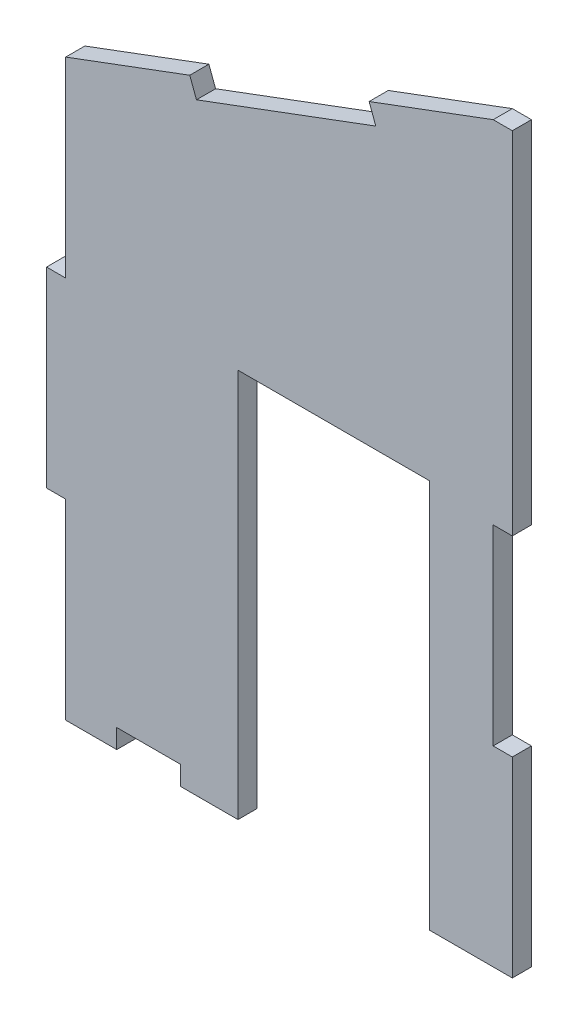
ISO-10303-21;
HEADER;
FILE_DESCRIPTION(('STEP AP214'),'2;1');
FILE_NAME('part.step','',(''),(''),'','','');
FILE_SCHEMA(('AUTOMOTIVE_DESIGN { 1 0 10303 214 1 1 1 1 }'));
ENDSEC;
DATA;
#1=APPLICATION_CONTEXT('core data for automotive mechanical design processes');
#2=APPLICATION_PROTOCOL_DEFINITION('international standard','automotive_design',2000,#1);
#3=PRODUCT_CONTEXT('',#1,'mechanical');
#4=PRODUCT('Part','Part','',(#3));
#5=PRODUCT_RELATED_PRODUCT_CATEGORY('part','',(#4));
#6=PRODUCT_DEFINITION_FORMATION('','',#4);
#7=PRODUCT_DEFINITION_CONTEXT('part definition',#1,'design');
#8=PRODUCT_DEFINITION('design','',#6,#7);
#9=PRODUCT_DEFINITION_SHAPE('','',#8);
#10=(LENGTH_UNIT() NAMED_UNIT(*) SI_UNIT(.MILLI.,.METRE.));
#11=(NAMED_UNIT(*) PLANE_ANGLE_UNIT() SI_UNIT($,.RADIAN.));
#12=(NAMED_UNIT(*) SI_UNIT($,.STERADIAN.) SOLID_ANGLE_UNIT());
#13=UNCERTAINTY_MEASURE_WITH_UNIT(LENGTH_MEASURE(1.E-05),#10,'distance_accuracy_value','');
#14=(GEOMETRIC_REPRESENTATION_CONTEXT(3) GLOBAL_UNCERTAINTY_ASSIGNED_CONTEXT((#13)) GLOBAL_UNIT_ASSIGNED_CONTEXT((#10,
#11,#12)) REPRESENTATION_CONTEXT('',''));
#15=CARTESIAN_POINT('',(0.,0.,0.));
#16=DIRECTION('',(0.,0.,1.));
#17=DIRECTION('',(1.,0.,0.));
#18=AXIS2_PLACEMENT_3D('',#15,#16,#17);
#19=CARTESIAN_POINT('',(251.627918025392,254.123752973224,3.));
#20=DIRECTION('',(-1.,0.,0.));
#21=DIRECTION('',(0.,-1.,0.));
#22=AXIS2_PLACEMENT_3D('',#19,#20,#21);
#23=PLANE('',#22);
#24=DIRECTION('',(0.,1.,0.));
#25=VECTOR('',#24,1.);
#26=CARTESIAN_POINT('',(251.627918025392,254.123752973224,0.));
#27=LINE('',#26,#25);
#28=CARTESIAN_POINT('',(251.627918025392,199.123752973223,0.));
#29=VERTEX_POINT('',#28);
#30=CARTESIAN_POINT('',(251.627918025392,254.123752973224,0.));
#31=VERTEX_POINT('',#30);
#32=EDGE_CURVE('E231',#29,#31,#27,.T.);
#33=ORIENTED_EDGE('',*,*,#32,.T.);
#34=DIRECTION('',(0.,0.,-1.));
#35=VECTOR('',#34,1.);
#36=CARTESIAN_POINT('',(251.627918025392,254.123752973224,3.));
#37=LINE('',#36,#35);
#38=CARTESIAN_POINT('',(251.627918025392,254.123752973224,3.));
#39=VERTEX_POINT('',#38);
#40=EDGE_CURVE('E11',#39,#31,#37,.T.);
#41=ORIENTED_EDGE('',*,*,#40,.F.);
#42=DIRECTION('',(0.,1.,0.));
#43=VECTOR('',#42,1.);
#44=CARTESIAN_POINT('',(251.627918025392,254.123752973224,3.));
#45=LINE('',#44,#43);
#46=CARTESIAN_POINT('',(251.627918025392,199.123752973223,3.));
#47=VERTEX_POINT('',#46);
#48=EDGE_CURVE('E279',#47,#39,#45,.T.);
#49=ORIENTED_EDGE('',*,*,#48,.F.);
#50=DIRECTION('',(0.,0.,-1.));
#51=VECTOR('',#50,1.);
#52=CARTESIAN_POINT('',(251.627918025392,199.123752973223,3.));
#53=LINE('',#52,#51);
#54=EDGE_CURVE('E227',#47,#29,#53,.T.);
#55=ORIENTED_EDGE('',*,*,#54,.T.);
#56=EDGE_LOOP('',(#33,#41,#49,#55));
#57=FACE_BOUND('',#56,.T.);
#58=ADVANCED_FACE('F33',(#57),#23,.F.);
#59=CARTESIAN_POINT('',(248.627918025392,254.123752973223,3.));
#60=DIRECTION('',(0.,-1.,0.));
#61=DIRECTION('',(1.,0.,0.));
#62=AXIS2_PLACEMENT_3D('',#59,#60,#61);
#63=PLANE('',#62);
#64=DIRECTION('',(-1.,0.,0.));
#65=VECTOR('',#64,1.);
#66=CARTESIAN_POINT('',(248.627918025392,254.123752973223,0.));
#67=LINE('',#66,#65);
#68=CARTESIAN_POINT('',(248.627918025392,254.123752973223,0.));
#69=VERTEX_POINT('',#68);
#70=EDGE_CURVE('E234',#31,#69,#67,.T.);
#71=ORIENTED_EDGE('',*,*,#70,.T.);
#72=DIRECTION('',(0.,0.,-1.));
#73=VECTOR('',#72,1.);
#74=CARTESIAN_POINT('',(248.627918025392,254.123752973223,3.));
#75=LINE('',#74,#73);
#76=CARTESIAN_POINT('',(248.627918025392,254.123752973223,3.));
#77=VERTEX_POINT('',#76);
#78=EDGE_CURVE('E41',#77,#69,#75,.T.);
#79=ORIENTED_EDGE('',*,*,#78,.F.);
#80=DIRECTION('',(-1.,0.,0.));
#81=VECTOR('',#80,1.);
#82=CARTESIAN_POINT('',(248.627918025392,254.123752973223,3.));
#83=LINE('',#82,#81);
#84=EDGE_CURVE('E143',#39,#77,#83,.T.);
#85=ORIENTED_EDGE('',*,*,#84,.F.);
#86=ORIENTED_EDGE('',*,*,#40,.T.);
#87=EDGE_LOOP('',(#71,#79,#85,#86));
#88=FACE_BOUND('',#87,.T.);
#89=ADVANCED_FACE('F422',(#88),#63,.F.);
#90=CARTESIAN_POINT('',(248.627918025392,254.123752973223,3.));
#91=DIRECTION('',(0.349590519725871,-0.936902592865339,0.));
#92=DIRECTION('',(0.936902592865339,0.349590519725871,0.));
#93=AXIS2_PLACEMENT_3D('',#90,#91,#92);
#94=PLANE('',#93);
#95=DIRECTION('',(-0.936902592865339,-0.349590519725871,0.));
#96=VECTOR('',#95,1.);
#97=CARTESIAN_POINT('',(248.627918025392,254.123752973223,0.));
#98=LINE('',#97,#96);
#99=CARTESIAN_POINT('',(229.181456918372,246.867610769112,0.));
#100=VERTEX_POINT('',#99);
#101=EDGE_CURVE('E236',#69,#100,#98,.T.);
#102=ORIENTED_EDGE('',*,*,#101,.T.);
#103=DIRECTION('',(0.,0.,-1.));
#104=VECTOR('',#103,1.);
#105=CARTESIAN_POINT('',(229.181456918372,246.867610769112,3.));
#106=LINE('',#105,#104);
#107=CARTESIAN_POINT('',(229.181456918372,246.867610769112,3.));
#108=VERTEX_POINT('',#107);
#109=EDGE_CURVE('E337',#108,#100,#106,.T.);
#110=ORIENTED_EDGE('',*,*,#109,.F.);
#111=DIRECTION('',(-0.936902592865339,-0.349590519725871,0.));
#112=VECTOR('',#111,1.);
#113=CARTESIAN_POINT('',(248.627918025392,254.123752973223,3.));
#114=LINE('',#113,#112);
#115=EDGE_CURVE('E345',#77,#108,#114,.T.);
#116=ORIENTED_EDGE('',*,*,#115,.F.);
#117=ORIENTED_EDGE('',*,*,#78,.T.);
#118=EDGE_LOOP('',(#102,#110,#116,#117));
#119=FACE_BOUND('',#118,.T.);
#120=ADVANCED_FACE('F343',(#119),#94,.F.);
#121=CARTESIAN_POINT('',(229.181456918372,246.867610769112,3.));
#122=DIRECTION('',(0.936902592865339,0.349590519725872,0.));
#123=DIRECTION('',(-0.349590519725873,0.936902592865339,0.));
#124=AXIS2_PLACEMENT_3D('',#121,#122,#123);
#125=PLANE('',#124);
#126=DIRECTION('',(0.349590519725873,-0.936902592865339,0.));
#127=VECTOR('',#126,1.);
#128=CARTESIAN_POINT('',(229.181456918372,246.867610769112,0.));
#129=LINE('',#128,#127);
#130=CARTESIAN_POINT('',(230.230228477549,244.056902990516,0.));
#131=VERTEX_POINT('',#130);
#132=EDGE_CURVE('E238',#100,#131,#129,.T.);
#133=ORIENTED_EDGE('',*,*,#132,.T.);
#134=DIRECTION('',(0.,0.,-1.));
#135=VECTOR('',#134,1.);
#136=CARTESIAN_POINT('',(230.230228477549,244.056902990516,3.));
#137=LINE('',#136,#135);
#138=CARTESIAN_POINT('',(230.230228477549,244.056902990516,3.));
#139=VERTEX_POINT('',#138);
#140=EDGE_CURVE('E334',#139,#131,#137,.T.);
#141=ORIENTED_EDGE('',*,*,#140,.F.);
#142=DIRECTION('',(0.349590519725873,-0.936902592865339,0.));
#143=VECTOR('',#142,1.);
#144=CARTESIAN_POINT('',(229.181456918372,246.867610769112,3.));
#145=LINE('',#144,#143);
#146=EDGE_CURVE('E363',#108,#139,#145,.T.);
#147=ORIENTED_EDGE('',*,*,#146,.F.);
#148=ORIENTED_EDGE('',*,*,#109,.T.);
#149=EDGE_LOOP('',(#133,#141,#147,#148));
#150=FACE_BOUND('',#149,.T.);
#151=ADVANCED_FACE('F354',(#150),#125,.F.);
#152=CARTESIAN_POINT('',(230.230228477549,244.056902990516,3.));
#153=DIRECTION('',(0.349590519725873,-0.936902592865338,0.));
#154=DIRECTION('',(0.936902592865338,0.349590519725873,0.));
#155=AXIS2_PLACEMENT_3D('',#152,#153,#154);
#156=PLANE('',#155);
#157=DIRECTION('',(-0.936902592865339,-0.349590519725873,0.));
#158=VECTOR('',#157,1.);
#159=CARTESIAN_POINT('',(230.230228477549,244.056902990516,0.));
#160=LINE('',#159,#158);
#161=CARTESIAN_POINT('',(202.123150691589,233.569187398739,0.));
#162=VERTEX_POINT('',#161);
#163=EDGE_CURVE('E240',#131,#162,#160,.T.);
#164=ORIENTED_EDGE('',*,*,#163,.T.);
#165=DIRECTION('',(0.,0.,-1.));
#166=VECTOR('',#165,1.);
#167=CARTESIAN_POINT('',(202.123150691589,233.569187398739,3.));
#168=LINE('',#167,#166);
#169=CARTESIAN_POINT('',(202.123150691589,233.569187398739,3.));
#170=VERTEX_POINT('',#169);
#171=EDGE_CURVE('E331',#170,#162,#168,.T.);
#172=ORIENTED_EDGE('',*,*,#171,.F.);
#173=DIRECTION('',(-0.936902592865339,-0.349590519725873,0.));
#174=VECTOR('',#173,1.);
#175=CARTESIAN_POINT('',(230.230228477549,244.056902990516,3.));
#176=LINE('',#175,#174);
#177=EDGE_CURVE('E360',#139,#170,#176,.T.);
#178=ORIENTED_EDGE('',*,*,#177,.F.);
#179=ORIENTED_EDGE('',*,*,#140,.T.);
#180=EDGE_LOOP('',(#164,#172,#178,#179));
#181=FACE_BOUND('',#180,.T.);
#182=ADVANCED_FACE('F358',(#181),#156,.F.);
#183=CARTESIAN_POINT('',(201.074379132412,236.379895177335,3.));
#184=DIRECTION('',(-0.936902592865339,-0.349590519725872,0.));
#185=DIRECTION('',(0.349590519725873,-0.936902592865339,0.));
#186=AXIS2_PLACEMENT_3D('',#183,#184,#185);
#187=PLANE('',#186);
#188=DIRECTION('',(-0.349590519725873,0.936902592865339,0.));
#189=VECTOR('',#188,1.);
#190=CARTESIAN_POINT('',(201.074379132412,236.379895177335,0.));
#191=LINE('',#190,#189);
#192=CARTESIAN_POINT('',(201.074379132412,236.379895177335,0.));
#193=VERTEX_POINT('',#192);
#194=EDGE_CURVE('E242',#162,#193,#191,.T.);
#195=ORIENTED_EDGE('',*,*,#194,.T.);
#196=DIRECTION('',(0.,0.,-1.));
#197=VECTOR('',#196,1.);
#198=CARTESIAN_POINT('',(201.074379132412,236.379895177335,3.));
#199=LINE('',#198,#197);
#200=CARTESIAN_POINT('',(201.074379132412,236.379895177335,3.));
#201=VERTEX_POINT('',#200);
#202=EDGE_CURVE('E328',#201,#193,#199,.T.);
#203=ORIENTED_EDGE('',*,*,#202,.F.);
#204=DIRECTION('',(-0.349590519725873,0.936902592865339,0.));
#205=VECTOR('',#204,1.);
#206=CARTESIAN_POINT('',(201.074379132412,236.379895177335,3.));
#207=LINE('',#206,#205);
#208=EDGE_CURVE('E362',#170,#201,#207,.T.);
#209=ORIENTED_EDGE('',*,*,#208,.F.);
#210=ORIENTED_EDGE('',*,*,#171,.T.);
#211=EDGE_LOOP('',(#195,#203,#209,#210));
#212=FACE_BOUND('',#211,.T.);
#213=ADVANCED_FACE('F435',(#212),#187,.F.);
#214=CARTESIAN_POINT('',(201.074379132412,236.379895177335,3.));
#215=DIRECTION('',(0.349590519725873,-0.936902592865338,0.));
#216=DIRECTION('',(0.936902592865338,0.349590519725873,0.));
#217=AXIS2_PLACEMENT_3D('',#214,#215,#216);
#218=PLANE('',#217);
#219=DIRECTION('',(-0.936902592865338,-0.349590519725873,0.));
#220=VECTOR('',#219,1.);
#221=CARTESIAN_POINT('',(201.074379132412,236.379895177335,0.));
#222=LINE('',#221,#220);
#223=CARTESIAN_POINT('',(181.627918025392,229.123752973223,0.));
#224=VERTEX_POINT('',#223);
#225=EDGE_CURVE('E244',#193,#224,#222,.T.);
#226=ORIENTED_EDGE('',*,*,#225,.T.);
#227=DIRECTION('',(0.,0.,-1.));
#228=VECTOR('',#227,1.);
#229=CARTESIAN_POINT('',(181.627918025392,229.123752973223,3.));
#230=LINE('',#229,#228);
#231=CARTESIAN_POINT('',(181.627918025392,229.123752973223,3.));
#232=VERTEX_POINT('',#231);
#233=EDGE_CURVE('E325',#232,#224,#230,.T.);
#234=ORIENTED_EDGE('',*,*,#233,.F.);
#235=DIRECTION('',(-0.936902592865338,-0.349590519725873,0.));
#236=VECTOR('',#235,1.);
#237=CARTESIAN_POINT('',(201.074379132412,236.379895177335,3.));
#238=LINE('',#237,#236);
#239=EDGE_CURVE('E365',#201,#232,#238,.T.);
#240=ORIENTED_EDGE('',*,*,#239,.F.);
#241=ORIENTED_EDGE('',*,*,#202,.T.);
#242=EDGE_LOOP('',(#226,#234,#240,#241));
#243=FACE_BOUND('',#242,.T.);
#244=ADVANCED_FACE('F438',(#243),#218,.F.);
#245=CARTESIAN_POINT('',(181.627918025392,199.123752973223,3.));
#246=DIRECTION('',(1.,0.,0.));
#247=DIRECTION('',(0.,0.,-1.));
#248=AXIS2_PLACEMENT_3D('',#245,#246,#247);
#249=PLANE('',#248);
#250=DIRECTION('',(0.,-1.,0.));
#251=VECTOR('',#250,1.);
#252=CARTESIAN_POINT('',(181.627918025392,199.123752973223,0.));
#253=LINE('',#252,#251);
#254=CARTESIAN_POINT('',(181.627918025392,199.123752973223,0.));
#255=VERTEX_POINT('',#254);
#256=EDGE_CURVE('E246',#224,#255,#253,.T.);
#257=ORIENTED_EDGE('',*,*,#256,.T.);
#258=DIRECTION('',(0.,0.,-1.));
#259=VECTOR('',#258,1.);
#260=CARTESIAN_POINT('',(181.627918025392,199.123752973223,3.));
#261=LINE('',#260,#259);
#262=CARTESIAN_POINT('',(181.627918025392,199.123752973223,3.));
#263=VERTEX_POINT('',#262);
#264=EDGE_CURVE('E322',#263,#255,#261,.T.);
#265=ORIENTED_EDGE('',*,*,#264,.F.);
#266=DIRECTION('',(0.,-1.,0.));
#267=VECTOR('',#266,1.);
#268=CARTESIAN_POINT('',(181.627918025392,199.123752973223,3.));
#269=LINE('',#268,#267);
#270=EDGE_CURVE('E371',#232,#263,#269,.T.);
#271=ORIENTED_EDGE('',*,*,#270,.F.);
#272=ORIENTED_EDGE('',*,*,#233,.T.);
#273=EDGE_LOOP('',(#257,#265,#271,#272));
#274=FACE_BOUND('',#273,.T.);
#275=ADVANCED_FACE('F442',(#274),#249,.F.);
#276=CARTESIAN_POINT('',(178.627918025392,199.123752973223,3.));
#277=DIRECTION('',(0.,-1.,0.));
#278=DIRECTION('',(1.,0.,0.));
#279=AXIS2_PLACEMENT_3D('',#276,#277,#278);
#280=PLANE('',#279);
#281=DIRECTION('',(-1.,0.,0.));
#282=VECTOR('',#281,1.);
#283=CARTESIAN_POINT('',(178.627918025392,199.123752973223,0.));
#284=LINE('',#283,#282);
#285=CARTESIAN_POINT('',(178.627918025392,199.123752973223,0.));
#286=VERTEX_POINT('',#285);
#287=EDGE_CURVE('E248',#255,#286,#284,.T.);
#288=ORIENTED_EDGE('',*,*,#287,.T.);
#289=DIRECTION('',(0.,0.,-1.));
#290=VECTOR('',#289,1.);
#291=CARTESIAN_POINT('',(178.627918025392,199.123752973223,3.));
#292=LINE('',#291,#290);
#293=CARTESIAN_POINT('',(178.627918025392,199.123752973223,3.));
#294=VERTEX_POINT('',#293);
#295=EDGE_CURVE('E319',#294,#286,#292,.T.);
#296=ORIENTED_EDGE('',*,*,#295,.F.);
#297=DIRECTION('',(-1.,0.,0.));
#298=VECTOR('',#297,1.);
#299=CARTESIAN_POINT('',(178.627918025392,199.123752973223,3.));
#300=LINE('',#299,#298);
#301=EDGE_CURVE('E373',#263,#294,#300,.T.);
#302=ORIENTED_EDGE('',*,*,#301,.F.);
#303=ORIENTED_EDGE('',*,*,#264,.T.);
#304=EDGE_LOOP('',(#288,#296,#302,#303));
#305=FACE_BOUND('',#304,.T.);
#306=ADVANCED_FACE('F446',(#305),#280,.F.);
#307=CARTESIAN_POINT('',(178.627918025392,199.123752973223,3.));
#308=DIRECTION('',(1.,0.,0.));
#309=DIRECTION('',(0.,0.,-1.));
#310=AXIS2_PLACEMENT_3D('',#307,#308,#309);
#311=PLANE('',#310);
#312=DIRECTION('',(0.,-1.,0.));
#313=VECTOR('',#312,1.);
#314=CARTESIAN_POINT('',(178.627918025392,199.123752973223,0.));
#315=LINE('',#314,#313);
#316=CARTESIAN_POINT('',(178.627918025392,169.123752973223,0.));
#317=VERTEX_POINT('',#316);
#318=EDGE_CURVE('E250',#286,#317,#315,.T.);
#319=ORIENTED_EDGE('',*,*,#318,.T.);
#320=DIRECTION('',(0.,0.,-1.));
#321=VECTOR('',#320,1.);
#322=CARTESIAN_POINT('',(178.627918025392,169.123752973223,3.));
#323=LINE('',#322,#321);
#324=CARTESIAN_POINT('',(178.627918025392,169.123752973223,3.));
#325=VERTEX_POINT('',#324);
#326=EDGE_CURVE('E316',#325,#317,#323,.T.);
#327=ORIENTED_EDGE('',*,*,#326,.F.);
#328=DIRECTION('',(0.,-1.,0.));
#329=VECTOR('',#328,1.);
#330=CARTESIAN_POINT('',(178.627918025392,199.123752973223,3.));
#331=LINE('',#330,#329);
#332=EDGE_CURVE('E375',#294,#325,#331,.T.);
#333=ORIENTED_EDGE('',*,*,#332,.F.);
#334=ORIENTED_EDGE('',*,*,#295,.T.);
#335=EDGE_LOOP('',(#319,#327,#333,#334));
#336=FACE_BOUND('',#335,.T.);
#337=ADVANCED_FACE('F450',(#336),#311,.F.);
#338=CARTESIAN_POINT('',(181.627918025392,169.123752973223,3.));
#339=DIRECTION('',(0.,1.,0.));
#340=DIRECTION('',(-1.,0.,0.));
#341=AXIS2_PLACEMENT_3D('',#338,#339,#340);
#342=PLANE('',#341);
#343=DIRECTION('',(1.,0.,0.));
#344=VECTOR('',#343,1.);
#345=CARTESIAN_POINT('',(181.627918025392,169.123752973223,0.));
#346=LINE('',#345,#344);
#347=CARTESIAN_POINT('',(181.627918025392,169.123752973223,0.));
#348=VERTEX_POINT('',#347);
#349=EDGE_CURVE('E252',#317,#348,#346,.T.);
#350=ORIENTED_EDGE('',*,*,#349,.T.);
#351=DIRECTION('',(0.,0.,-1.));
#352=VECTOR('',#351,1.);
#353=CARTESIAN_POINT('',(181.627918025392,169.123752973223,3.));
#354=LINE('',#353,#352);
#355=CARTESIAN_POINT('',(181.627918025392,169.123752973223,3.));
#356=VERTEX_POINT('',#355);
#357=EDGE_CURVE('E313',#356,#348,#354,.T.);
#358=ORIENTED_EDGE('',*,*,#357,.F.);
#359=DIRECTION('',(1.,0.,0.));
#360=VECTOR('',#359,1.);
#361=CARTESIAN_POINT('',(181.627918025392,169.123752973223,3.));
#362=LINE('',#361,#360);
#363=EDGE_CURVE('E377',#325,#356,#362,.T.);
#364=ORIENTED_EDGE('',*,*,#363,.F.);
#365=ORIENTED_EDGE('',*,*,#326,.T.);
#366=EDGE_LOOP('',(#350,#358,#364,#365));
#367=FACE_BOUND('',#366,.T.);
#368=ADVANCED_FACE('F454',(#367),#342,.F.);
#369=CARTESIAN_POINT('',(181.627918025392,139.123752973223,3.));
#370=DIRECTION('',(1.,0.,0.));
#371=DIRECTION('',(0.,0.,-1.));
#372=AXIS2_PLACEMENT_3D('',#369,#370,#371);
#373=PLANE('',#372);
#374=DIRECTION('',(0.,-1.,0.));
#375=VECTOR('',#374,1.);
#376=CARTESIAN_POINT('',(181.627918025392,139.123752973223,0.));
#377=LINE('',#376,#375);
#378=CARTESIAN_POINT('',(181.627918025392,139.123752973223,0.));
#379=VERTEX_POINT('',#378);
#380=EDGE_CURVE('E254',#348,#379,#377,.T.);
#381=ORIENTED_EDGE('',*,*,#380,.T.);
#382=DIRECTION('',(0.,0.,-1.));
#383=VECTOR('',#382,1.);
#384=CARTESIAN_POINT('',(181.627918025392,139.123752973223,3.));
#385=LINE('',#384,#383);
#386=CARTESIAN_POINT('',(181.627918025392,139.123752973223,3.));
#387=VERTEX_POINT('',#386);
#388=EDGE_CURVE('E310',#387,#379,#385,.T.);
#389=ORIENTED_EDGE('',*,*,#388,.F.);
#390=DIRECTION('',(0.,-1.,0.));
#391=VECTOR('',#390,1.);
#392=CARTESIAN_POINT('',(181.627918025392,139.123752973223,3.));
#393=LINE('',#392,#391);
#394=EDGE_CURVE('E379',#356,#387,#393,.T.);
#395=ORIENTED_EDGE('',*,*,#394,.F.);
#396=ORIENTED_EDGE('',*,*,#357,.T.);
#397=EDGE_LOOP('',(#381,#389,#395,#396));
#398=FACE_BOUND('',#397,.T.);
#399=ADVANCED_FACE('F458',(#398),#373,.F.);
#400=CARTESIAN_POINT('',(181.627918025392,139.123752973223,3.));
#401=DIRECTION('',(0.,1.,0.));
#402=DIRECTION('',(-1.,0.,0.));
#403=AXIS2_PLACEMENT_3D('',#400,#401,#402);
#404=PLANE('',#403);
#405=DIRECTION('',(1.,0.,0.));
#406=VECTOR('',#405,1.);
#407=CARTESIAN_POINT('',(181.627918025392,139.123752973223,0.));
#408=LINE('',#407,#406);
#409=CARTESIAN_POINT('',(189.627918025392,139.123752973223,0.));
#410=VERTEX_POINT('',#409);
#411=EDGE_CURVE('E256',#379,#410,#408,.T.);
#412=ORIENTED_EDGE('',*,*,#411,.T.);
#413=DIRECTION('',(0.,0.,-1.));
#414=VECTOR('',#413,1.);
#415=CARTESIAN_POINT('',(189.627918025392,139.123752973223,3.));
#416=LINE('',#415,#414);
#417=CARTESIAN_POINT('',(189.627918025392,139.123752973223,3.));
#418=VERTEX_POINT('',#417);
#419=EDGE_CURVE('E307',#418,#410,#416,.T.);
#420=ORIENTED_EDGE('',*,*,#419,.F.);
#421=DIRECTION('',(1.,0.,0.));
#422=VECTOR('',#421,1.);
#423=CARTESIAN_POINT('',(181.627918025392,139.123752973223,3.));
#424=LINE('',#423,#422);
#425=EDGE_CURVE('E381',#387,#418,#424,.T.);
#426=ORIENTED_EDGE('',*,*,#425,.F.);
#427=ORIENTED_EDGE('',*,*,#388,.T.);
#428=EDGE_LOOP('',(#412,#420,#426,#427));
#429=FACE_BOUND('',#428,.T.);
#430=ADVANCED_FACE('F462',(#429),#404,.F.);
#431=CARTESIAN_POINT('',(189.627918025392,139.123752973223,3.));
#432=DIRECTION('',(-1.,0.,0.));
#433=DIRECTION('',(0.,0.,1.));
#434=AXIS2_PLACEMENT_3D('',#431,#432,#433);
#435=PLANE('',#434);
#436=DIRECTION('',(0.,1.,0.));
#437=VECTOR('',#436,1.);
#438=CARTESIAN_POINT('',(189.627918025392,139.123752973223,0.));
#439=LINE('',#438,#437);
#440=CARTESIAN_POINT('',(189.627918025392,142.123752973223,0.));
#441=VERTEX_POINT('',#440);
#442=EDGE_CURVE('E258',#410,#441,#439,.T.);
#443=ORIENTED_EDGE('',*,*,#442,.T.);
#444=DIRECTION('',(0.,0.,-1.));
#445=VECTOR('',#444,1.);
#446=CARTESIAN_POINT('',(189.627918025392,142.123752973223,3.));
#447=LINE('',#446,#445);
#448=CARTESIAN_POINT('',(189.627918025392,142.123752973223,3.));
#449=VERTEX_POINT('',#448);
#450=EDGE_CURVE('E304',#449,#441,#447,.T.);
#451=ORIENTED_EDGE('',*,*,#450,.F.);
#452=DIRECTION('',(0.,1.,0.));
#453=VECTOR('',#452,1.);
#454=CARTESIAN_POINT('',(189.627918025392,139.123752973223,3.));
#455=LINE('',#454,#453);
#456=EDGE_CURVE('E383',#418,#449,#455,.T.);
#457=ORIENTED_EDGE('',*,*,#456,.F.);
#458=ORIENTED_EDGE('',*,*,#419,.T.);
#459=EDGE_LOOP('',(#443,#451,#457,#458));
#460=FACE_BOUND('',#459,.T.);
#461=ADVANCED_FACE('F466',(#460),#435,.F.);
#462=CARTESIAN_POINT('',(189.627918025392,142.123752973223,3.));
#463=DIRECTION('',(0.,1.,0.));
#464=DIRECTION('',(0.,0.,1.));
#465=AXIS2_PLACEMENT_3D('',#462,#463,#464);
#466=PLANE('',#465);
#467=DIRECTION('',(1.,0.,0.));
#468=VECTOR('',#467,1.);
#469=CARTESIAN_POINT('',(189.627918025392,142.123752973223,0.));
#470=LINE('',#469,#468);
#471=CARTESIAN_POINT('',(199.627918025392,142.123752973223,0.));
#472=VERTEX_POINT('',#471);
#473=EDGE_CURVE('E260',#441,#472,#470,.T.);
#474=ORIENTED_EDGE('',*,*,#473,.T.);
#475=DIRECTION('',(0.,0.,-1.));
#476=VECTOR('',#475,1.);
#477=CARTESIAN_POINT('',(199.627918025392,142.123752973223,3.));
#478=LINE('',#477,#476);
#479=CARTESIAN_POINT('',(199.627918025392,142.123752973223,3.));
#480=VERTEX_POINT('',#479);
#481=EDGE_CURVE('E301',#480,#472,#478,.T.);
#482=ORIENTED_EDGE('',*,*,#481,.F.);
#483=DIRECTION('',(1.,0.,0.));
#484=VECTOR('',#483,1.);
#485=CARTESIAN_POINT('',(189.627918025392,142.123752973223,3.));
#486=LINE('',#485,#484);
#487=EDGE_CURVE('E385',#449,#480,#486,.T.);
#488=ORIENTED_EDGE('',*,*,#487,.F.);
#489=ORIENTED_EDGE('',*,*,#450,.T.);
#490=EDGE_LOOP('',(#474,#482,#488,#489));
#491=FACE_BOUND('',#490,.T.);
#492=ADVANCED_FACE('F470',(#491),#466,.F.);
#493=CARTESIAN_POINT('',(199.627918025392,142.123752973223,3.));
#494=DIRECTION('',(1.,0.,0.));
#495=DIRECTION('',(0.,0.,-1.));
#496=AXIS2_PLACEMENT_3D('',#493,#494,#495);
#497=PLANE('',#496);
#498=DIRECTION('',(0.,-1.,0.));
#499=VECTOR('',#498,1.);
#500=CARTESIAN_POINT('',(199.627918025392,142.123752973223,0.));
#501=LINE('',#500,#499);
#502=CARTESIAN_POINT('',(199.627918025392,139.123752973223,0.));
#503=VERTEX_POINT('',#502);
#504=EDGE_CURVE('E262',#472,#503,#501,.T.);
#505=ORIENTED_EDGE('',*,*,#504,.T.);
#506=DIRECTION('',(0.,0.,-1.));
#507=VECTOR('',#506,1.);
#508=CARTESIAN_POINT('',(199.627918025392,139.123752973223,3.));
#509=LINE('',#508,#507);
#510=CARTESIAN_POINT('',(199.627918025392,139.123752973223,3.));
#511=VERTEX_POINT('',#510);
#512=EDGE_CURVE('E298',#511,#503,#509,.T.);
#513=ORIENTED_EDGE('',*,*,#512,.F.);
#514=DIRECTION('',(0.,-1.,0.));
#515=VECTOR('',#514,1.);
#516=CARTESIAN_POINT('',(199.627918025392,142.123752973223,3.));
#517=LINE('',#516,#515);
#518=EDGE_CURVE('E387',#480,#511,#517,.T.);
#519=ORIENTED_EDGE('',*,*,#518,.F.);
#520=ORIENTED_EDGE('',*,*,#481,.T.);
#521=EDGE_LOOP('',(#505,#513,#519,#520));
#522=FACE_BOUND('',#521,.T.);
#523=ADVANCED_FACE('F474',(#522),#497,.F.);
#524=CARTESIAN_POINT('',(199.627918025392,139.123752973223,3.));
#525=DIRECTION('',(0.,1.,0.));
#526=DIRECTION('',(-1.,0.,0.));
#527=AXIS2_PLACEMENT_3D('',#524,#525,#526);
#528=PLANE('',#527);
#529=DIRECTION('',(1.,0.,0.));
#530=VECTOR('',#529,1.);
#531=CARTESIAN_POINT('',(199.627918025392,139.123752973223,0.));
#532=LINE('',#531,#530);
#533=CARTESIAN_POINT('',(208.627918025392,139.123752973223,0.));
#534=VERTEX_POINT('',#533);
#535=EDGE_CURVE('E264',#503,#534,#532,.T.);
#536=ORIENTED_EDGE('',*,*,#535,.T.);
#537=DIRECTION('',(0.,0.,-1.));
#538=VECTOR('',#537,1.);
#539=CARTESIAN_POINT('',(208.627918025392,139.123752973223,3.));
#540=LINE('',#539,#538);
#541=CARTESIAN_POINT('',(208.627918025392,139.123752973223,3.));
#542=VERTEX_POINT('',#541);
#543=EDGE_CURVE('E295',#542,#534,#540,.T.);
#544=ORIENTED_EDGE('',*,*,#543,.F.);
#545=DIRECTION('',(1.,0.,0.));
#546=VECTOR('',#545,1.);
#547=CARTESIAN_POINT('',(199.627918025392,139.123752973223,3.));
#548=LINE('',#547,#546);
#549=EDGE_CURVE('E389',#511,#542,#548,.T.);
#550=ORIENTED_EDGE('',*,*,#549,.F.);
#551=ORIENTED_EDGE('',*,*,#512,.T.);
#552=EDGE_LOOP('',(#536,#544,#550,#551));
#553=FACE_BOUND('',#552,.T.);
#554=ADVANCED_FACE('F478',(#553),#528,.F.);
#555=CARTESIAN_POINT('',(208.627918025392,200.123752973223,3.));
#556=DIRECTION('',(-1.,0.,0.));
#557=DIRECTION('',(0.,0.,1.));
#558=AXIS2_PLACEMENT_3D('',#555,#556,#557);
#559=PLANE('',#558);
#560=DIRECTION('',(0.,1.,0.));
#561=VECTOR('',#560,1.);
#562=CARTESIAN_POINT('',(208.627918025392,200.123752973223,0.));
#563=LINE('',#562,#561);
#564=CARTESIAN_POINT('',(208.627918025392,200.123752973223,0.));
#565=VERTEX_POINT('',#564);
#566=EDGE_CURVE('E266',#534,#565,#563,.T.);
#567=ORIENTED_EDGE('',*,*,#566,.T.);
#568=DIRECTION('',(0.,0.,-1.));
#569=VECTOR('',#568,1.);
#570=CARTESIAN_POINT('',(208.627918025392,200.123752973223,3.));
#571=LINE('',#570,#569);
#572=CARTESIAN_POINT('',(208.627918025392,200.123752973223,3.));
#573=VERTEX_POINT('',#572);
#574=EDGE_CURVE('E292',#573,#565,#571,.T.);
#575=ORIENTED_EDGE('',*,*,#574,.F.);
#576=DIRECTION('',(0.,1.,0.));
#577=VECTOR('',#576,1.);
#578=CARTESIAN_POINT('',(208.627918025392,200.123752973223,3.));
#579=LINE('',#578,#577);
#580=EDGE_CURVE('E391',#542,#573,#579,.T.);
#581=ORIENTED_EDGE('',*,*,#580,.F.);
#582=ORIENTED_EDGE('',*,*,#543,.T.);
#583=EDGE_LOOP('',(#567,#575,#581,#582));
#584=FACE_BOUND('',#583,.T.);
#585=ADVANCED_FACE('F482',(#584),#559,.F.);
#586=CARTESIAN_POINT('',(238.627918025392,200.123752973223,3.));
#587=DIRECTION('',(0.,1.,0.));
#588=DIRECTION('',(-1.,0.,0.));
#589=AXIS2_PLACEMENT_3D('',#586,#587,#588);
#590=PLANE('',#589);
#591=DIRECTION('',(1.,0.,0.));
#592=VECTOR('',#591,1.);
#593=CARTESIAN_POINT('',(238.627918025392,200.123752973223,0.));
#594=LINE('',#593,#592);
#595=CARTESIAN_POINT('',(238.627918025392,200.123752973223,0.));
#596=VERTEX_POINT('',#595);
#597=EDGE_CURVE('E268',#565,#596,#594,.T.);
#598=ORIENTED_EDGE('',*,*,#597,.T.);
#599=DIRECTION('',(0.,0.,-1.));
#600=VECTOR('',#599,1.);
#601=CARTESIAN_POINT('',(238.627918025392,200.123752973223,3.));
#602=LINE('',#601,#600);
#603=CARTESIAN_POINT('',(238.627918025392,200.123752973223,3.));
#604=VERTEX_POINT('',#603);
#605=EDGE_CURVE('E289',#604,#596,#602,.T.);
#606=ORIENTED_EDGE('',*,*,#605,.F.);
#607=DIRECTION('',(1.,0.,0.));
#608=VECTOR('',#607,1.);
#609=CARTESIAN_POINT('',(238.627918025392,200.123752973223,3.));
#610=LINE('',#609,#608);
#611=EDGE_CURVE('E393',#573,#604,#610,.T.);
#612=ORIENTED_EDGE('',*,*,#611,.F.);
#613=ORIENTED_EDGE('',*,*,#574,.T.);
#614=EDGE_LOOP('',(#598,#606,#612,#613));
#615=FACE_BOUND('',#614,.T.);
#616=ADVANCED_FACE('F486',(#615),#590,.F.);
#617=CARTESIAN_POINT('',(238.627918025392,139.123752973223,3.));
#618=DIRECTION('',(1.,0.,0.));
#619=DIRECTION('',(0.,0.,-1.));
#620=AXIS2_PLACEMENT_3D('',#617,#618,#619);
#621=PLANE('',#620);
#622=DIRECTION('',(0.,-1.,0.));
#623=VECTOR('',#622,1.);
#624=CARTESIAN_POINT('',(238.627918025392,139.123752973223,0.));
#625=LINE('',#624,#623);
#626=CARTESIAN_POINT('',(238.627918025392,139.123752973223,0.));
#627=VERTEX_POINT('',#626);
#628=EDGE_CURVE('E270',#596,#627,#625,.T.);
#629=ORIENTED_EDGE('',*,*,#628,.T.);
#630=DIRECTION('',(0.,0.,-1.));
#631=VECTOR('',#630,1.);
#632=CARTESIAN_POINT('',(238.627918025392,139.123752973223,3.));
#633=LINE('',#632,#631);
#634=CARTESIAN_POINT('',(238.627918025392,139.123752973223,3.));
#635=VERTEX_POINT('',#634);
#636=EDGE_CURVE('E286',#635,#627,#633,.T.);
#637=ORIENTED_EDGE('',*,*,#636,.F.);
#638=DIRECTION('',(0.,-1.,0.));
#639=VECTOR('',#638,1.);
#640=CARTESIAN_POINT('',(238.627918025392,139.123752973223,3.));
#641=LINE('',#640,#639);
#642=EDGE_CURVE('E395',#604,#635,#641,.T.);
#643=ORIENTED_EDGE('',*,*,#642,.F.);
#644=ORIENTED_EDGE('',*,*,#605,.T.);
#645=EDGE_LOOP('',(#629,#637,#643,#644));
#646=FACE_BOUND('',#645,.T.);
#647=ADVANCED_FACE('F490',(#646),#621,.F.);
#648=CARTESIAN_POINT('',(251.627918025392,139.123752973223,3.));
#649=DIRECTION('',(0.,1.,0.));
#650=DIRECTION('',(-1.,0.,0.));
#651=AXIS2_PLACEMENT_3D('',#648,#649,#650);
#652=PLANE('',#651);
#653=DIRECTION('',(1.,0.,0.));
#654=VECTOR('',#653,1.);
#655=CARTESIAN_POINT('',(251.627918025392,139.123752973223,0.));
#656=LINE('',#655,#654);
#657=CARTESIAN_POINT('',(251.627918025392,139.123752973223,0.));
#658=VERTEX_POINT('',#657);
#659=EDGE_CURVE('E272',#627,#658,#656,.T.);
#660=ORIENTED_EDGE('',*,*,#659,.T.);
#661=DIRECTION('',(0.,0.,-1.));
#662=VECTOR('',#661,1.);
#663=CARTESIAN_POINT('',(251.627918025392,139.123752973223,3.));
#664=LINE('',#663,#662);
#665=CARTESIAN_POINT('',(251.627918025392,139.123752973223,3.));
#666=VERTEX_POINT('',#665);
#667=EDGE_CURVE('E283',#666,#658,#664,.T.);
#668=ORIENTED_EDGE('',*,*,#667,.F.);
#669=DIRECTION('',(1.,0.,0.));
#670=VECTOR('',#669,1.);
#671=CARTESIAN_POINT('',(251.627918025392,139.123752973223,3.));
#672=LINE('',#671,#670);
#673=EDGE_CURVE('E397',#635,#666,#672,.T.);
#674=ORIENTED_EDGE('',*,*,#673,.F.);
#675=ORIENTED_EDGE('',*,*,#636,.T.);
#676=EDGE_LOOP('',(#660,#668,#674,#675));
#677=FACE_BOUND('',#676,.T.);
#678=ADVANCED_FACE('F403',(#677),#652,.F.);
#679=CARTESIAN_POINT('',(251.627918025392,169.123752973223,3.));
#680=DIRECTION('',(-1.,0.,0.));
#681=DIRECTION('',(0.,0.,1.));
#682=AXIS2_PLACEMENT_3D('',#679,#680,#681);
#683=PLANE('',#682);
#684=DIRECTION('',(0.,1.,0.));
#685=VECTOR('',#684,1.);
#686=CARTESIAN_POINT('',(251.627918025392,169.123752973223,0.));
#687=LINE('',#686,#685);
#688=CARTESIAN_POINT('',(251.627918025392,169.123752973223,0.));
#689=VERTEX_POINT('',#688);
#690=EDGE_CURVE('E274',#658,#689,#687,.T.);
#691=ORIENTED_EDGE('',*,*,#690,.T.);
#692=DIRECTION('',(0.,0.,-1.));
#693=VECTOR('',#692,1.);
#694=CARTESIAN_POINT('',(251.627918025392,169.123752973223,3.));
#695=LINE('',#694,#693);
#696=CARTESIAN_POINT('',(251.627918025392,169.123752973223,3.));
#697=VERTEX_POINT('',#696);
#698=EDGE_CURVE('E222',#697,#689,#695,.T.);
#699=ORIENTED_EDGE('',*,*,#698,.F.);
#700=DIRECTION('',(0.,1.,0.));
#701=VECTOR('',#700,1.);
#702=CARTESIAN_POINT('',(251.627918025392,169.123752973223,3.));
#703=LINE('',#702,#701);
#704=EDGE_CURVE('E213',#666,#697,#703,.T.);
#705=ORIENTED_EDGE('',*,*,#704,.F.);
#706=ORIENTED_EDGE('',*,*,#667,.T.);
#707=EDGE_LOOP('',(#691,#699,#705,#706));
#708=FACE_BOUND('',#707,.T.);
#709=ADVANCED_FACE('F407',(#708),#683,.F.);
#710=CARTESIAN_POINT('',(251.627918025392,169.123752973223,3.));
#711=DIRECTION('',(0.,-1.,0.));
#712=DIRECTION('',(1.,0.,0.));
#713=AXIS2_PLACEMENT_3D('',#710,#711,#712);
#714=PLANE('',#713);
#715=DIRECTION('',(-1.,0.,0.));
#716=VECTOR('',#715,1.);
#717=CARTESIAN_POINT('',(251.627918025392,169.123752973223,0.));
#718=LINE('',#717,#716);
#719=CARTESIAN_POINT('',(248.627918025392,169.123752973223,0.));
#720=VERTEX_POINT('',#719);
#721=EDGE_CURVE('E221',#689,#720,#718,.T.);
#722=ORIENTED_EDGE('',*,*,#721,.T.);
#723=DIRECTION('',(0.,0.,-1.));
#724=VECTOR('',#723,1.);
#725=CARTESIAN_POINT('',(248.627918025392,169.123752973223,3.));
#726=LINE('',#725,#724);
#727=CARTESIAN_POINT('',(248.627918025392,169.123752973223,3.));
#728=VERTEX_POINT('',#727);
#729=EDGE_CURVE('E218',#728,#720,#726,.T.);
#730=ORIENTED_EDGE('',*,*,#729,.F.);
#731=DIRECTION('',(-1.,0.,0.));
#732=VECTOR('',#731,1.);
#733=CARTESIAN_POINT('',(251.627918025392,169.123752973223,3.));
#734=LINE('',#733,#732);
#735=EDGE_CURVE('E207',#697,#728,#734,.T.);
#736=ORIENTED_EDGE('',*,*,#735,.F.);
#737=ORIENTED_EDGE('',*,*,#698,.T.);
#738=EDGE_LOOP('',(#722,#730,#736,#737));
#739=FACE_BOUND('',#738,.T.);
#740=ADVANCED_FACE('F219',(#739),#714,.F.);
#741=CARTESIAN_POINT('',(248.627918025392,169.123752973223,3.));
#742=DIRECTION('',(-1.,0.,0.));
#743=DIRECTION('',(0.,0.,1.));
#744=AXIS2_PLACEMENT_3D('',#741,#742,#743);
#745=PLANE('',#744);
#746=DIRECTION('',(0.,1.,0.));
#747=VECTOR('',#746,1.);
#748=CARTESIAN_POINT('',(248.627918025392,169.123752973223,0.));
#749=LINE('',#748,#747);
#750=CARTESIAN_POINT('',(248.627918025392,199.123752973223,0.));
#751=VERTEX_POINT('',#750);
#752=EDGE_CURVE('E129',#720,#751,#749,.T.);
#753=ORIENTED_EDGE('',*,*,#752,.T.);
#754=DIRECTION('',(0.,0.,-1.));
#755=VECTOR('',#754,1.);
#756=CARTESIAN_POINT('',(248.627918025392,199.123752973223,3.));
#757=LINE('',#756,#755);
#758=CARTESIAN_POINT('',(248.627918025392,199.123752973223,3.));
#759=VERTEX_POINT('',#758);
#760=EDGE_CURVE('E223',#759,#751,#757,.T.);
#761=ORIENTED_EDGE('',*,*,#760,.F.);
#762=DIRECTION('',(0.,1.,0.));
#763=VECTOR('',#762,1.);
#764=CARTESIAN_POINT('',(248.627918025392,169.123752973223,3.));
#765=LINE('',#764,#763);
#766=EDGE_CURVE('E211',#728,#759,#765,.T.);
#767=ORIENTED_EDGE('',*,*,#766,.F.);
#768=ORIENTED_EDGE('',*,*,#729,.T.);
#769=EDGE_LOOP('',(#753,#761,#767,#768));
#770=FACE_BOUND('',#769,.T.);
#771=ADVANCED_FACE('F225',(#770),#745,.F.);
#772=CARTESIAN_POINT('',(248.627918025392,199.123752973223,3.));
#773=DIRECTION('',(0.,1.,0.));
#774=DIRECTION('',(0.,0.,1.));
#775=AXIS2_PLACEMENT_3D('',#772,#773,#774);
#776=PLANE('',#775);
#777=DIRECTION('',(1.,0.,0.));
#778=VECTOR('',#777,1.);
#779=CARTESIAN_POINT('',(248.627918025392,199.123752973223,0.));
#780=LINE('',#779,#778);
#781=EDGE_CURVE('E135',#751,#29,#780,.T.);
#782=ORIENTED_EDGE('',*,*,#781,.T.);
#783=ORIENTED_EDGE('',*,*,#54,.F.);
#784=DIRECTION('',(1.,0.,0.));
#785=VECTOR('',#784,1.);
#786=CARTESIAN_POINT('',(248.627918025392,199.123752973223,3.));
#787=LINE('',#786,#785);
#788=EDGE_CURVE('E49',#759,#47,#787,.T.);
#789=ORIENTED_EDGE('',*,*,#788,.F.);
#790=ORIENTED_EDGE('',*,*,#760,.T.);
#791=EDGE_LOOP('',(#782,#783,#789,#790));
#792=FACE_BOUND('',#791,.T.);
#793=ADVANCED_FACE('F411',(#792),#776,.F.);
#794=CARTESIAN_POINT('',(0.,0.,3.));
#795=DIRECTION('',(0.,0.,1.));
#796=DIRECTION('',(1.,0.,0.));
#797=AXIS2_PLACEMENT_3D('',#794,#795,#796);
#798=PLANE('',#797);
#799=ORIENTED_EDGE('',*,*,#48,.T.);
#800=ORIENTED_EDGE('',*,*,#84,.T.);
#801=ORIENTED_EDGE('',*,*,#115,.T.);
#802=ORIENTED_EDGE('',*,*,#146,.T.);
#803=ORIENTED_EDGE('',*,*,#177,.T.);
#804=ORIENTED_EDGE('',*,*,#208,.T.);
#805=ORIENTED_EDGE('',*,*,#239,.T.);
#806=ORIENTED_EDGE('',*,*,#270,.T.);
#807=ORIENTED_EDGE('',*,*,#301,.T.);
#808=ORIENTED_EDGE('',*,*,#332,.T.);
#809=ORIENTED_EDGE('',*,*,#363,.T.);
#810=ORIENTED_EDGE('',*,*,#394,.T.);
#811=ORIENTED_EDGE('',*,*,#425,.T.);
#812=ORIENTED_EDGE('',*,*,#456,.T.);
#813=ORIENTED_EDGE('',*,*,#487,.T.);
#814=ORIENTED_EDGE('',*,*,#518,.T.);
#815=ORIENTED_EDGE('',*,*,#549,.T.);
#816=ORIENTED_EDGE('',*,*,#580,.T.);
#817=ORIENTED_EDGE('',*,*,#611,.T.);
#818=ORIENTED_EDGE('',*,*,#642,.T.);
#819=ORIENTED_EDGE('',*,*,#673,.T.);
#820=ORIENTED_EDGE('',*,*,#704,.T.);
#821=ORIENTED_EDGE('',*,*,#735,.T.);
#822=ORIENTED_EDGE('',*,*,#766,.T.);
#823=ORIENTED_EDGE('',*,*,#788,.T.);
#824=EDGE_LOOP('',(#799,#800,#801,#802,#803,#804,#805,#806,#807,#808,#809,#810,#811,#812,#813,
#814,#815,#816,#817,#818,#819,#820,#821,#822,#823));
#825=FACE_BOUND('',#824,.T.);
#826=ADVANCED_FACE('F209',(#825),#798,.T.);
#827=CARTESIAN_POINT('',(0.,0.,0.));
#828=DIRECTION('',(0.,0.,1.));
#829=DIRECTION('',(1.,0.,0.));
#830=AXIS2_PLACEMENT_3D('',#827,#828,#829);
#831=PLANE('',#830);
#832=ORIENTED_EDGE('',*,*,#32,.F.);
#833=ORIENTED_EDGE('',*,*,#781,.F.);
#834=ORIENTED_EDGE('',*,*,#752,.F.);
#835=ORIENTED_EDGE('',*,*,#721,.F.);
#836=ORIENTED_EDGE('',*,*,#690,.F.);
#837=ORIENTED_EDGE('',*,*,#659,.F.);
#838=ORIENTED_EDGE('',*,*,#628,.F.);
#839=ORIENTED_EDGE('',*,*,#597,.F.);
#840=ORIENTED_EDGE('',*,*,#566,.F.);
#841=ORIENTED_EDGE('',*,*,#535,.F.);
#842=ORIENTED_EDGE('',*,*,#504,.F.);
#843=ORIENTED_EDGE('',*,*,#473,.F.);
#844=ORIENTED_EDGE('',*,*,#442,.F.);
#845=ORIENTED_EDGE('',*,*,#411,.F.);
#846=ORIENTED_EDGE('',*,*,#380,.F.);
#847=ORIENTED_EDGE('',*,*,#349,.F.);
#848=ORIENTED_EDGE('',*,*,#318,.F.);
#849=ORIENTED_EDGE('',*,*,#287,.F.);
#850=ORIENTED_EDGE('',*,*,#256,.F.);
#851=ORIENTED_EDGE('',*,*,#225,.F.);
#852=ORIENTED_EDGE('',*,*,#194,.F.);
#853=ORIENTED_EDGE('',*,*,#163,.F.);
#854=ORIENTED_EDGE('',*,*,#132,.F.);
#855=ORIENTED_EDGE('',*,*,#101,.F.);
#856=ORIENTED_EDGE('',*,*,#70,.F.);
#857=EDGE_LOOP('',(#832,#833,#834,#835,#836,#837,#838,#839,#840,#841,#842,#843,#844,#845,#846,
#847,#848,#849,#850,#851,#852,#853,#854,#855,#856));
#858=FACE_BOUND('',#857,.T.);
#859=ADVANCED_FACE('F349',(#858),#831,.F.);
#860=CLOSED_SHELL('',(#58,#89,#120,#151,#182,#213,#244,#275,#306,#337,#368,#399,#430,#461,#492,
#523,#554,#585,#616,#647,#678,#709,#740,#771,#793,#826,#859));
#861=MANIFOLD_SOLID_BREP('B2',#860);
#862=ADVANCED_BREP_SHAPE_REPRESENTATION('',(#18,#861),#14);
#863=SHAPE_DEFINITION_REPRESENTATION(#9,#862);
ENDSEC;
END-ISO-10303-21;
